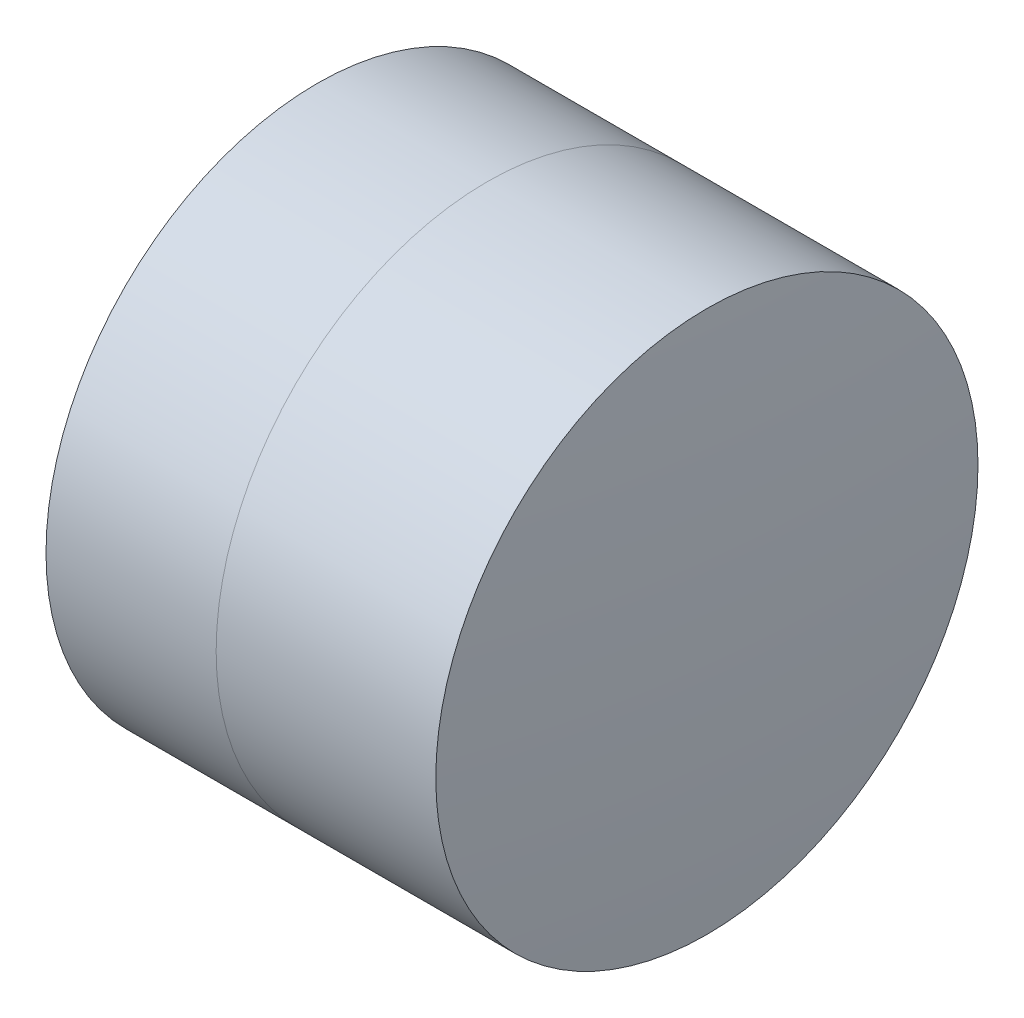
ISO-10303-21;
HEADER;
FILE_DESCRIPTION(('STEP AP214'),'2;1');
FILE_NAME('part.step','',(''),(''),'','','');
FILE_SCHEMA(('AUTOMOTIVE_DESIGN { 1 0 10303 214 1 1 1 1 }'));
ENDSEC;
DATA;
#1=APPLICATION_CONTEXT('core data for automotive mechanical design processes');
#2=APPLICATION_PROTOCOL_DEFINITION('international standard','automotive_design',2000,#1);
#3=PRODUCT_CONTEXT('',#1,'mechanical');
#4=PRODUCT('Part','Part','',(#3));
#5=PRODUCT_RELATED_PRODUCT_CATEGORY('part','',(#4));
#6=PRODUCT_DEFINITION_FORMATION('','',#4);
#7=PRODUCT_DEFINITION_CONTEXT('part definition',#1,'design');
#8=PRODUCT_DEFINITION('design','',#6,#7);
#9=PRODUCT_DEFINITION_SHAPE('','',#8);
#10=(LENGTH_UNIT() NAMED_UNIT(*) SI_UNIT(.MILLI.,.METRE.));
#11=(NAMED_UNIT(*) PLANE_ANGLE_UNIT() SI_UNIT($,.RADIAN.));
#12=(NAMED_UNIT(*) SI_UNIT($,.STERADIAN.) SOLID_ANGLE_UNIT());
#13=UNCERTAINTY_MEASURE_WITH_UNIT(LENGTH_MEASURE(1.E-05),#10,'distance_accuracy_value','');
#14=(GEOMETRIC_REPRESENTATION_CONTEXT(3) GLOBAL_UNCERTAINTY_ASSIGNED_CONTEXT((#13)) GLOBAL_UNIT_ASSIGNED_CONTEXT((#10,
#11,#12)) REPRESENTATION_CONTEXT('',''));
#15=CARTESIAN_POINT('',(0.,0.,0.));
#16=DIRECTION('',(0.,0.,1.));
#17=DIRECTION('',(1.,0.,0.));
#18=AXIS2_PLACEMENT_3D('',#15,#16,#17);
#19=CARTESIAN_POINT('',(255.632149058082,0.,0.));
#20=DIRECTION('',(-1.,0.,0.));
#21=DIRECTION('',(0.,0.,1.));
#22=AXIS2_PLACEMENT_3D('',#19,#20,#21);
#23=SPHERICAL_SURFACE('',#22,7.6);
#24=CARTESIAN_POINT('',(262.809195804482,0.,0.));
#25=DIRECTION('',(-1.,0.,0.));
#26=DIRECTION('',(0.,0.,1.));
#27=AXIS2_PLACEMENT_3D('',#24,#25,#26);
#28=CIRCLE('',#27,2.5);
#29=CARTESIAN_POINT('',(262.809195804482,0.,2.5));
#30=VERTEX_POINT('',#29);
#31=EDGE_CURVE('E11',#30,#30,#28,.T.);
#32=ORIENTED_EDGE('',*,*,#31,.T.);
#33=EDGE_LOOP('',(#32));
#34=FACE_BOUND('',#33,.T.);
#35=ADVANCED_FACE('F45',(#34),#23,.F.);
#36=CARTESIAN_POINT('',(-0.551919992657797,0.,0.));
#37=DIRECTION('',(-1.,0.,0.));
#38=DIRECTION('',(0.,0.,1.));
#39=AXIS2_PLACEMENT_3D('',#36,#37,#38);
#40=CYLINDRICAL_SURFACE('',#39,2.5);
#41=CARTESIAN_POINT('',(264.834648960434,0.,0.));
#42=DIRECTION('',(-1.,0.,0.));
#43=DIRECTION('',(0.,0.,1.));
#44=AXIS2_PLACEMENT_3D('',#41,#42,#43);
#45=CIRCLE('',#44,2.5);
#46=CARTESIAN_POINT('',(264.834648960434,0.,2.5));
#47=VERTEX_POINT('',#46);
#48=EDGE_CURVE('E51',#47,#47,#45,.T.);
#49=ORIENTED_EDGE('',*,*,#48,.T.);
#50=EDGE_LOOP('',(#49));
#51=FACE_BOUND('',#50,.T.);
#52=ORIENTED_EDGE('',*,*,#31,.F.);
#53=EDGE_LOOP('',(#52));
#54=FACE_BOUND('',#53,.T.);
#55=ADVANCED_FACE('F57',(#51,#54),#40,.T.);
#56=CARTESIAN_POINT('',(232.832149058082,0.,0.));
#57=DIRECTION('',(-1.,0.,0.));
#58=DIRECTION('',(0.,0.,1.));
#59=AXIS2_PLACEMENT_3D('',#56,#57,#58);
#60=SPHERICAL_SURFACE('',#59,32.0999999999999);
#61=ORIENTED_EDGE('',*,*,#48,.F.);
#62=EDGE_LOOP('',(#61));
#63=FACE_BOUND('',#62,.T.);
#64=ADVANCED_FACE('F60',(#63),#60,.T.);
#65=CLOSED_SHELL('',(#35,#55,#64));
#66=MANIFOLD_SOLID_BREP('B2',#65);
#67=CARTESIAN_POINT('',(271.232149058082,0.,0.));
#68=DIRECTION('',(-1.,0.,0.));
#69=DIRECTION('',(0.,0.,-1.));
#70=AXIS2_PLACEMENT_3D('',#67,#68,#69);
#71=SPHERICAL_SURFACE('',#70,10.3);
#72=CARTESIAN_POINT('',(261.240152260645,0.,0.));
#73=DIRECTION('',(-1.,0.,0.));
#74=DIRECTION('',(0.,0.,1.));
#75=AXIS2_PLACEMENT_3D('',#72,#73,#74);
#76=CIRCLE('',#75,2.5);
#77=CARTESIAN_POINT('',(261.240152260645,0.,2.5));
#78=VERTEX_POINT('',#77);
#79=EDGE_CURVE('E44',#78,#78,#76,.T.);
#80=ORIENTED_EDGE('',*,*,#79,.T.);
#81=EDGE_LOOP('',(#80));
#82=FACE_BOUND('',#81,.T.);
#83=ADVANCED_FACE('F86',(#82),#71,.T.);
#84=CARTESIAN_POINT('',(124.523309526045,0.,0.));
#85=DIRECTION('',(-1.,0.,0.));
#86=DIRECTION('',(0.,0.,1.));
#87=AXIS2_PLACEMENT_3D('',#84,#85,#86);
#88=CYLINDRICAL_SURFACE('',#87,2.5);
#89=CARTESIAN_POINT('',(262.809195804482,0.,0.));
#90=DIRECTION('',(-1.,0.,0.));
#91=DIRECTION('',(0.,0.,1.));
#92=AXIS2_PLACEMENT_3D('',#89,#90,#91);
#93=CIRCLE('',#92,2.5);
#94=CARTESIAN_POINT('',(262.809195804482,0.,2.5));
#95=VERTEX_POINT('',#94);
#96=EDGE_CURVE('E92',#95,#95,#93,.T.);
#97=ORIENTED_EDGE('',*,*,#96,.T.);
#98=EDGE_LOOP('',(#97));
#99=FACE_BOUND('',#98,.T.);
#100=ORIENTED_EDGE('',*,*,#79,.F.);
#101=EDGE_LOOP('',(#100));
#102=FACE_BOUND('',#101,.T.);
#103=ADVANCED_FACE('F98',(#99,#102),#88,.T.);
#104=CARTESIAN_POINT('',(255.632149058082,0.,0.));
#105=DIRECTION('',(-1.,0.,0.));
#106=DIRECTION('',(0.,0.,1.));
#107=AXIS2_PLACEMENT_3D('',#104,#105,#106);
#108=SPHERICAL_SURFACE('',#107,7.6);
#109=ORIENTED_EDGE('',*,*,#96,.F.);
#110=EDGE_LOOP('',(#109));
#111=FACE_BOUND('',#110,.T.);
#112=ADVANCED_FACE('F101',(#111),#108,.T.);
#113=CLOSED_SHELL('',(#83,#103,#112));
#114=MANIFOLD_SOLID_BREP('B6',#113);
#115=ADVANCED_BREP_SHAPE_REPRESENTATION('',(#18,#66,#114),#14);
#116=SHAPE_DEFINITION_REPRESENTATION(#9,#115);
ENDSEC;
END-ISO-10303-21;
